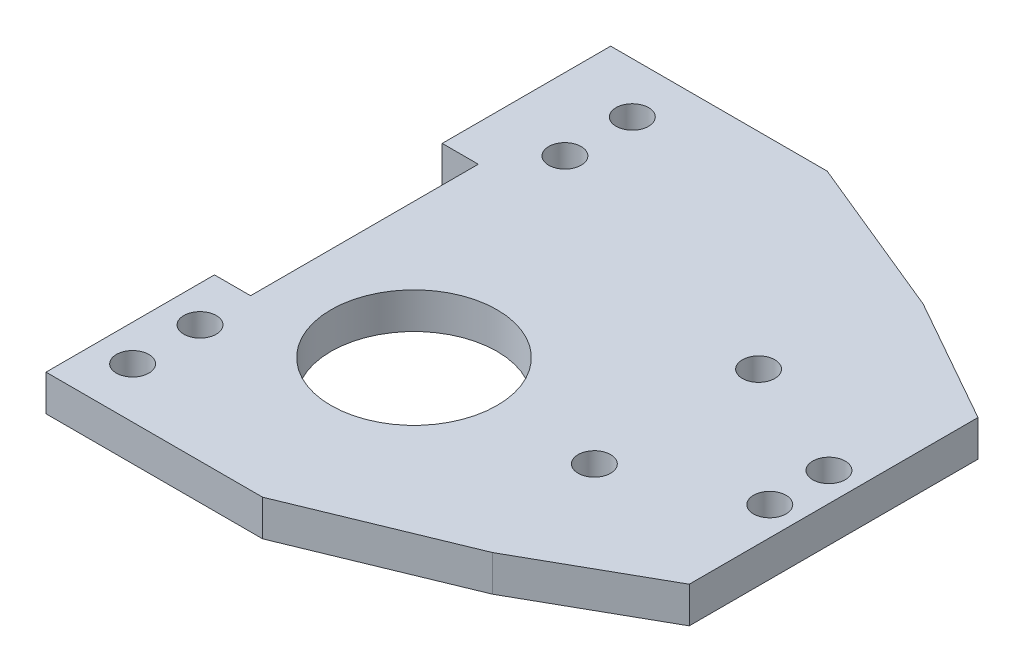
ISO-10303-21;
HEADER;
FILE_DESCRIPTION(('STEP AP214'),'2;1');
FILE_NAME('part.step','',(''),(''),'','','');
FILE_SCHEMA(('AUTOMOTIVE_DESIGN { 1 0 10303 214 1 1 1 1 }'));
ENDSEC;
DATA;
#1=APPLICATION_CONTEXT('core data for automotive mechanical design processes');
#2=APPLICATION_PROTOCOL_DEFINITION('international standard','automotive_design',2000,#1);
#3=PRODUCT_CONTEXT('',#1,'mechanical');
#4=PRODUCT('Part','Part','',(#3));
#5=PRODUCT_RELATED_PRODUCT_CATEGORY('part','',(#4));
#6=PRODUCT_DEFINITION_FORMATION('','',#4);
#7=PRODUCT_DEFINITION_CONTEXT('part definition',#1,'design');
#8=PRODUCT_DEFINITION('design','',#6,#7);
#9=PRODUCT_DEFINITION_SHAPE('','',#8);
#10=(LENGTH_UNIT() NAMED_UNIT(*) SI_UNIT(.MILLI.,.METRE.));
#11=(NAMED_UNIT(*) PLANE_ANGLE_UNIT() SI_UNIT($,.RADIAN.));
#12=(NAMED_UNIT(*) SI_UNIT($,.STERADIAN.) SOLID_ANGLE_UNIT());
#13=UNCERTAINTY_MEASURE_WITH_UNIT(LENGTH_MEASURE(1.E-05),#10,'distance_accuracy_value','');
#14=(GEOMETRIC_REPRESENTATION_CONTEXT(3) GLOBAL_UNCERTAINTY_ASSIGNED_CONTEXT((#13)) GLOBAL_UNIT_ASSIGNED_CONTEXT((#10,
#11,#12)) REPRESENTATION_CONTEXT('',''));
#15=CARTESIAN_POINT('',(0.,0.,0.));
#16=DIRECTION('',(0.,0.,1.));
#17=DIRECTION('',(1.,0.,0.));
#18=AXIS2_PLACEMENT_3D('',#15,#16,#17);
#19=CARTESIAN_POINT('',(-40.7506429404021,0.,15.7743934541941));
#20=DIRECTION('',(0.,0.,-1.));
#21=DIRECTION('',(-1.,0.,0.));
#22=AXIS2_PLACEMENT_3D('',#19,#20,#21);
#23=PLANE('',#22);
#24=DIRECTION('',(1.,0.,0.));
#25=VECTOR('',#24,1.);
#26=CARTESIAN_POINT('',(-40.7506429404021,-5.,15.7743934541941));
#27=LINE('',#26,#25);
#28=CARTESIAN_POINT('',(-40.7506429404021,-5.,15.7743934541941));
#29=VERTEX_POINT('',#28);
#30=CARTESIAN_POINT('',(-35.750642940402,-5.,15.7743934541941));
#31=VERTEX_POINT('',#30);
#32=EDGE_CURVE('E158',#29,#31,#27,.T.);
#33=ORIENTED_EDGE('',*,*,#32,.F.);
#34=DIRECTION('',(0.,-1.,0.));
#35=VECTOR('',#34,1.);
#36=CARTESIAN_POINT('',(-40.7506429404021,0.,15.7743934541941));
#37=LINE('',#36,#35);
#38=CARTESIAN_POINT('',(-40.7506429404021,0.,15.7743934541941));
#39=VERTEX_POINT('',#38);
#40=EDGE_CURVE('E11',#39,#29,#37,.T.);
#41=ORIENTED_EDGE('',*,*,#40,.F.);
#42=DIRECTION('',(1.,0.,0.));
#43=VECTOR('',#42,1.);
#44=CARTESIAN_POINT('',(-40.7506429404021,0.,15.7743934541941));
#45=LINE('',#44,#43);
#46=CARTESIAN_POINT('',(-35.750642940402,0.,15.7743934541941));
#47=VERTEX_POINT('',#46);
#48=EDGE_CURVE('E191',#39,#47,#45,.T.);
#49=ORIENTED_EDGE('',*,*,#48,.T.);
#50=DIRECTION('',(0.,-1.,0.));
#51=VECTOR('',#50,1.);
#52=CARTESIAN_POINT('',(-35.750642940402,0.,15.7743934541941));
#53=LINE('',#52,#51);
#54=EDGE_CURVE('E40',#47,#31,#53,.T.);
#55=ORIENTED_EDGE('',*,*,#54,.T.);
#56=EDGE_LOOP('',(#33,#41,#49,#55));
#57=FACE_BOUND('',#56,.T.);
#58=ADVANCED_FACE('F37',(#57),#23,.T.);
#59=CARTESIAN_POINT('',(-40.7506429404021,0.,39.1125659953177));
#60=DIRECTION('',(-1.,0.,0.));
#61=DIRECTION('',(0.,0.,1.));
#62=AXIS2_PLACEMENT_3D('',#59,#60,#61);
#63=PLANE('',#62);
#64=DIRECTION('',(0.,0.,-1.));
#65=VECTOR('',#64,1.);
#66=CARTESIAN_POINT('',(-40.7506429404021,-5.,39.1125659953177));
#67=LINE('',#66,#65);
#68=CARTESIAN_POINT('',(-40.7506429404021,-5.,39.1125659953177));
#69=VERTEX_POINT('',#68);
#70=EDGE_CURVE('E189',#69,#29,#67,.T.);
#71=ORIENTED_EDGE('',*,*,#70,.F.);
#72=DIRECTION('',(0.,-1.,0.));
#73=VECTOR('',#72,1.);
#74=CARTESIAN_POINT('',(-40.7506429404021,0.,39.1125659953177));
#75=LINE('',#74,#73);
#76=CARTESIAN_POINT('',(-40.7506429404021,0.,39.1125659953177));
#77=VERTEX_POINT('',#76);
#78=EDGE_CURVE('E46',#77,#69,#75,.T.);
#79=ORIENTED_EDGE('',*,*,#78,.F.);
#80=DIRECTION('',(0.,0.,-1.));
#81=VECTOR('',#80,1.);
#82=CARTESIAN_POINT('',(-40.7506429404021,0.,39.1125659953177));
#83=LINE('',#82,#81);
#84=EDGE_CURVE('E148',#77,#39,#83,.T.);
#85=ORIENTED_EDGE('',*,*,#84,.T.);
#86=ORIENTED_EDGE('',*,*,#40,.T.);
#87=EDGE_LOOP('',(#71,#79,#85,#86));
#88=FACE_BOUND('',#87,.T.);
#89=ADVANCED_FACE('F211',(#88),#63,.T.);
#90=CARTESIAN_POINT('',(-10.750642940402,0.,39.1125659953177));
#91=DIRECTION('',(0.,0.,1.));
#92=DIRECTION('',(1.,0.,0.));
#93=AXIS2_PLACEMENT_3D('',#90,#91,#92);
#94=PLANE('',#93);
#95=DIRECTION('',(-1.,0.,0.));
#96=VECTOR('',#95,1.);
#97=CARTESIAN_POINT('',(-10.750642940402,-5.,39.1125659953177));
#98=LINE('',#97,#96);
#99=CARTESIAN_POINT('',(-10.750642940402,-5.,39.1125659953177));
#100=VERTEX_POINT('',#99);
#101=EDGE_CURVE('E135',#100,#69,#98,.T.);
#102=ORIENTED_EDGE('',*,*,#101,.F.);
#103=DIRECTION('',(0.,-1.,0.));
#104=VECTOR('',#103,1.);
#105=CARTESIAN_POINT('',(-10.750642940402,0.,39.1125659953177));
#106=LINE('',#105,#104);
#107=CARTESIAN_POINT('',(-10.750642940402,0.,39.1125659953177));
#108=VERTEX_POINT('',#107);
#109=EDGE_CURVE('E130',#108,#100,#106,.T.);
#110=ORIENTED_EDGE('',*,*,#109,.F.);
#111=DIRECTION('',(-1.,0.,0.));
#112=VECTOR('',#111,1.);
#113=CARTESIAN_POINT('',(-10.750642940402,0.,39.1125659953177));
#114=LINE('',#113,#112);
#115=EDGE_CURVE('E133',#108,#77,#114,.T.);
#116=ORIENTED_EDGE('',*,*,#115,.T.);
#117=ORIENTED_EDGE('',*,*,#78,.T.);
#118=EDGE_LOOP('',(#102,#110,#116,#117));
#119=FACE_BOUND('',#118,.T.);
#120=ADVANCED_FACE('F132',(#119),#94,.T.);
#121=CARTESIAN_POINT('',(11.8281740085253,0.,29.8235625462976));
#122=DIRECTION('',(0.380464141149531,0.,0.924795673270236));
#123=DIRECTION('',(0.924795673270236,0.,-0.380464141149531));
#124=AXIS2_PLACEMENT_3D('',#121,#122,#123);
#125=PLANE('',#124);
#126=DIRECTION('',(-0.924795673270236,0.,0.380464141149531));
#127=VECTOR('',#126,1.);
#128=CARTESIAN_POINT('',(11.8281740085253,-5.,29.8235625462976));
#129=LINE('',#128,#127);
#130=CARTESIAN_POINT('',(11.8281740085253,-5.,29.8235625462976));
#131=VERTEX_POINT('',#130);
#132=EDGE_CURVE('E186',#131,#100,#129,.T.);
#133=ORIENTED_EDGE('',*,*,#132,.F.);
#134=DIRECTION('',(0.,-1.,0.));
#135=VECTOR('',#134,1.);
#136=CARTESIAN_POINT('',(11.8281740085253,0.,29.8235625462976));
#137=LINE('',#136,#135);
#138=CARTESIAN_POINT('',(11.8281740085253,0.,29.8235625462976));
#139=VERTEX_POINT('',#138);
#140=EDGE_CURVE('E140',#139,#131,#137,.T.);
#141=ORIENTED_EDGE('',*,*,#140,.F.);
#142=DIRECTION('',(-0.924795673270236,0.,0.380464141149531));
#143=VECTOR('',#142,1.);
#144=CARTESIAN_POINT('',(11.8281740085253,0.,29.8235625462976));
#145=LINE('',#144,#143);
#146=EDGE_CURVE('E146',#139,#108,#145,.T.);
#147=ORIENTED_EDGE('',*,*,#146,.T.);
#148=ORIENTED_EDGE('',*,*,#109,.T.);
#149=EDGE_LOOP('',(#133,#141,#147,#148));
#150=FACE_BOUND('',#149,.T.);
#151=ADVANCED_FACE('F150',(#150),#125,.T.);
#152=CARTESIAN_POINT('',(29.249357059598,0.,20.));
#153=DIRECTION('',(0.491178127314878,0.,0.871059152553631));
#154=DIRECTION('',(0.871059152553631,0.,-0.491178127314878));
#155=AXIS2_PLACEMENT_3D('',#152,#153,#154);
#156=PLANE('',#155);
#157=DIRECTION('',(-0.871059152553631,0.,0.491178127314878));
#158=VECTOR('',#157,1.);
#159=CARTESIAN_POINT('',(29.249357059598,-5.,20.));
#160=LINE('',#159,#158);
#161=CARTESIAN_POINT('',(29.249357059598,-5.,20.));
#162=VERTEX_POINT('',#161);
#163=EDGE_CURVE('E183',#162,#131,#160,.T.);
#164=ORIENTED_EDGE('',*,*,#163,.F.);
#165=DIRECTION('',(0.,-1.,0.));
#166=VECTOR('',#165,1.);
#167=CARTESIAN_POINT('',(29.249357059598,0.,20.));
#168=LINE('',#167,#166);
#169=CARTESIAN_POINT('',(29.249357059598,0.,20.));
#170=VERTEX_POINT('',#169);
#171=EDGE_CURVE('E195',#170,#162,#168,.T.);
#172=ORIENTED_EDGE('',*,*,#171,.F.);
#173=DIRECTION('',(-0.871059152553631,0.,0.491178127314878));
#174=VECTOR('',#173,1.);
#175=CARTESIAN_POINT('',(29.249357059598,0.,20.));
#176=LINE('',#175,#174);
#177=EDGE_CURVE('E151',#170,#139,#176,.T.);
#178=ORIENTED_EDGE('',*,*,#177,.T.);
#179=ORIENTED_EDGE('',*,*,#140,.T.);
#180=EDGE_LOOP('',(#164,#172,#178,#179));
#181=FACE_BOUND('',#180,.T.);
#182=ADVANCED_FACE('F224',(#181),#156,.T.);
#183=CARTESIAN_POINT('',(29.249357059598,0.,-20.));
#184=DIRECTION('',(1.,0.,0.));
#185=DIRECTION('',(0.,0.,-1.));
#186=AXIS2_PLACEMENT_3D('',#183,#184,#185);
#187=PLANE('',#186);
#188=DIRECTION('',(0.,0.,1.));
#189=VECTOR('',#188,1.);
#190=CARTESIAN_POINT('',(29.249357059598,-5.,-20.));
#191=LINE('',#190,#189);
#192=CARTESIAN_POINT('',(29.249357059598,-5.,-20.));
#193=VERTEX_POINT('',#192);
#194=EDGE_CURVE('E180',#193,#162,#191,.T.);
#195=ORIENTED_EDGE('',*,*,#194,.F.);
#196=DIRECTION('',(0.,-1.,0.));
#197=VECTOR('',#196,1.);
#198=CARTESIAN_POINT('',(29.249357059598,0.,-20.));
#199=LINE('',#198,#197);
#200=CARTESIAN_POINT('',(29.249357059598,0.,-20.));
#201=VERTEX_POINT('',#200);
#202=EDGE_CURVE('E197',#201,#193,#199,.T.);
#203=ORIENTED_EDGE('',*,*,#202,.F.);
#204=DIRECTION('',(0.,0.,1.));
#205=VECTOR('',#204,1.);
#206=CARTESIAN_POINT('',(29.249357059598,0.,-20.));
#207=LINE('',#206,#205);
#208=EDGE_CURVE('E153',#201,#170,#207,.T.);
#209=ORIENTED_EDGE('',*,*,#208,.T.);
#210=ORIENTED_EDGE('',*,*,#171,.T.);
#211=EDGE_LOOP('',(#195,#203,#209,#210));
#212=FACE_BOUND('',#211,.T.);
#213=ADVANCED_FACE('F227',(#212),#187,.T.);
#214=CARTESIAN_POINT('',(11.8281740085253,0.,-29.8235625462976));
#215=DIRECTION('',(0.491178127314878,0.,-0.871059152553631));
#216=DIRECTION('',(-0.871059152553631,0.,-0.491178127314878));
#217=AXIS2_PLACEMENT_3D('',#214,#215,#216);
#218=PLANE('',#217);
#219=DIRECTION('',(0.871059152553631,0.,0.491178127314878));
#220=VECTOR('',#219,1.);
#221=CARTESIAN_POINT('',(11.8281740085253,-5.,-29.8235625462976));
#222=LINE('',#221,#220);
#223=CARTESIAN_POINT('',(11.8281740085253,-5.,-29.8235625462976));
#224=VERTEX_POINT('',#223);
#225=EDGE_CURVE('E177',#224,#193,#222,.T.);
#226=ORIENTED_EDGE('',*,*,#225,.F.);
#227=DIRECTION('',(0.,-1.,0.));
#228=VECTOR('',#227,1.);
#229=CARTESIAN_POINT('',(11.8281740085253,0.,-29.8235625462976));
#230=LINE('',#229,#228);
#231=CARTESIAN_POINT('',(11.8281740085253,0.,-29.8235625462976));
#232=VERTEX_POINT('',#231);
#233=EDGE_CURVE('E199',#232,#224,#230,.T.);
#234=ORIENTED_EDGE('',*,*,#233,.F.);
#235=DIRECTION('',(0.871059152553631,0.,0.491178127314878));
#236=VECTOR('',#235,1.);
#237=CARTESIAN_POINT('',(11.8281740085253,0.,-29.8235625462976));
#238=LINE('',#237,#236);
#239=EDGE_CURVE('E371',#232,#201,#238,.T.);
#240=ORIENTED_EDGE('',*,*,#239,.T.);
#241=ORIENTED_EDGE('',*,*,#202,.T.);
#242=EDGE_LOOP('',(#226,#234,#240,#241));
#243=FACE_BOUND('',#242,.T.);
#244=ADVANCED_FACE('F231',(#243),#218,.T.);
#245=CARTESIAN_POINT('',(-10.750642940402,0.,-39.1125659953177));
#246=DIRECTION('',(0.380464141149529,0.,-0.924795673270237));
#247=DIRECTION('',(-0.924795673270237,0.,-0.380464141149529));
#248=AXIS2_PLACEMENT_3D('',#245,#246,#247);
#249=PLANE('',#248);
#250=DIRECTION('',(0.924795673270237,0.,0.380464141149529));
#251=VECTOR('',#250,1.);
#252=CARTESIAN_POINT('',(-10.750642940402,-5.,-39.1125659953177));
#253=LINE('',#252,#251);
#254=CARTESIAN_POINT('',(-10.750642940402,-5.,-39.1125659953177));
#255=VERTEX_POINT('',#254);
#256=EDGE_CURVE('E174',#255,#224,#253,.T.);
#257=ORIENTED_EDGE('',*,*,#256,.F.);
#258=DIRECTION('',(0.,-1.,0.));
#259=VECTOR('',#258,1.);
#260=CARTESIAN_POINT('',(-10.750642940402,0.,-39.1125659953177));
#261=LINE('',#260,#259);
#262=CARTESIAN_POINT('',(-10.750642940402,0.,-39.1125659953177));
#263=VERTEX_POINT('',#262);
#264=EDGE_CURVE('E201',#263,#255,#261,.T.);
#265=ORIENTED_EDGE('',*,*,#264,.F.);
#266=DIRECTION('',(0.924795673270237,0.,0.380464141149529));
#267=VECTOR('',#266,1.);
#268=CARTESIAN_POINT('',(-10.750642940402,0.,-39.1125659953177));
#269=LINE('',#268,#267);
#270=EDGE_CURVE('E368',#263,#232,#269,.T.);
#271=ORIENTED_EDGE('',*,*,#270,.T.);
#272=ORIENTED_EDGE('',*,*,#233,.T.);
#273=EDGE_LOOP('',(#257,#265,#271,#272));
#274=FACE_BOUND('',#273,.T.);
#275=ADVANCED_FACE('F235',(#274),#249,.T.);
#276=CARTESIAN_POINT('',(-40.7506429404021,0.,-39.1125659953177));
#277=DIRECTION('',(0.,0.,-1.));
#278=DIRECTION('',(-1.,0.,0.));
#279=AXIS2_PLACEMENT_3D('',#276,#277,#278);
#280=PLANE('',#279);
#281=DIRECTION('',(1.,0.,0.));
#282=VECTOR('',#281,1.);
#283=CARTESIAN_POINT('',(-40.7506429404021,-5.,-39.1125659953177));
#284=LINE('',#283,#282);
#285=CARTESIAN_POINT('',(-40.7506429404021,-5.,-39.1125659953177));
#286=VERTEX_POINT('',#285);
#287=EDGE_CURVE('E171',#286,#255,#284,.T.);
#288=ORIENTED_EDGE('',*,*,#287,.F.);
#289=DIRECTION('',(0.,-1.,0.));
#290=VECTOR('',#289,1.);
#291=CARTESIAN_POINT('',(-40.7506429404021,0.,-39.1125659953177));
#292=LINE('',#291,#290);
#293=CARTESIAN_POINT('',(-40.7506429404021,0.,-39.1125659953177));
#294=VERTEX_POINT('',#293);
#295=EDGE_CURVE('E203',#294,#286,#292,.T.);
#296=ORIENTED_EDGE('',*,*,#295,.F.);
#297=DIRECTION('',(1.,0.,0.));
#298=VECTOR('',#297,1.);
#299=CARTESIAN_POINT('',(-40.7506429404021,0.,-39.1125659953177));
#300=LINE('',#299,#298);
#301=EDGE_CURVE('E365',#294,#263,#300,.T.);
#302=ORIENTED_EDGE('',*,*,#301,.T.);
#303=ORIENTED_EDGE('',*,*,#264,.T.);
#304=EDGE_LOOP('',(#288,#296,#302,#303));
#305=FACE_BOUND('',#304,.T.);
#306=ADVANCED_FACE('F239',(#305),#280,.T.);
#307=CARTESIAN_POINT('',(-40.7506429404021,0.,-15.7743934541941));
#308=DIRECTION('',(-1.,0.,0.));
#309=DIRECTION('',(0.,0.,1.));
#310=AXIS2_PLACEMENT_3D('',#307,#308,#309);
#311=PLANE('',#310);
#312=DIRECTION('',(0.,0.,-1.));
#313=VECTOR('',#312,1.);
#314=CARTESIAN_POINT('',(-40.7506429404021,-5.,-15.7743934541941));
#315=LINE('',#314,#313);
#316=CARTESIAN_POINT('',(-40.7506429404021,-5.,-15.7743934541941));
#317=VERTEX_POINT('',#316);
#318=EDGE_CURVE('E168',#317,#286,#315,.T.);
#319=ORIENTED_EDGE('',*,*,#318,.F.);
#320=DIRECTION('',(0.,-1.,0.));
#321=VECTOR('',#320,1.);
#322=CARTESIAN_POINT('',(-40.7506429404021,0.,-15.7743934541941));
#323=LINE('',#322,#321);
#324=CARTESIAN_POINT('',(-40.7506429404021,0.,-15.7743934541941));
#325=VERTEX_POINT('',#324);
#326=EDGE_CURVE('E205',#325,#317,#323,.T.);
#327=ORIENTED_EDGE('',*,*,#326,.F.);
#328=DIRECTION('',(0.,0.,-1.));
#329=VECTOR('',#328,1.);
#330=CARTESIAN_POINT('',(-40.7506429404021,0.,-15.7743934541941));
#331=LINE('',#330,#329);
#332=EDGE_CURVE('E362',#325,#294,#331,.T.);
#333=ORIENTED_EDGE('',*,*,#332,.T.);
#334=ORIENTED_EDGE('',*,*,#295,.T.);
#335=EDGE_LOOP('',(#319,#327,#333,#334));
#336=FACE_BOUND('',#335,.T.);
#337=ADVANCED_FACE('F243',(#336),#311,.T.);
#338=CARTESIAN_POINT('',(-35.750642940402,0.,-15.7743934541941));
#339=DIRECTION('',(0.,0.,1.));
#340=DIRECTION('',(1.,0.,0.));
#341=AXIS2_PLACEMENT_3D('',#338,#339,#340);
#342=PLANE('',#341);
#343=DIRECTION('',(-1.,0.,0.));
#344=VECTOR('',#343,1.);
#345=CARTESIAN_POINT('',(-35.750642940402,-5.,-15.7743934541941));
#346=LINE('',#345,#344);
#347=CARTESIAN_POINT('',(-35.750642940402,-5.,-15.7743934541941));
#348=VERTEX_POINT('',#347);
#349=EDGE_CURVE('E165',#348,#317,#346,.T.);
#350=ORIENTED_EDGE('',*,*,#349,.F.);
#351=DIRECTION('',(0.,-1.,0.));
#352=VECTOR('',#351,1.);
#353=CARTESIAN_POINT('',(-35.750642940402,0.,-15.7743934541941));
#354=LINE('',#353,#352);
#355=CARTESIAN_POINT('',(-35.750642940402,0.,-15.7743934541941));
#356=VERTEX_POINT('',#355);
#357=EDGE_CURVE('E206',#356,#348,#354,.T.);
#358=ORIENTED_EDGE('',*,*,#357,.F.);
#359=DIRECTION('',(-1.,0.,0.));
#360=VECTOR('',#359,1.);
#361=CARTESIAN_POINT('',(-35.750642940402,0.,-15.7743934541941));
#362=LINE('',#361,#360);
#363=EDGE_CURVE('E359',#356,#325,#362,.T.);
#364=ORIENTED_EDGE('',*,*,#363,.T.);
#365=ORIENTED_EDGE('',*,*,#326,.T.);
#366=EDGE_LOOP('',(#350,#358,#364,#365));
#367=FACE_BOUND('',#366,.T.);
#368=ADVANCED_FACE('F247',(#367),#342,.T.);
#369=CARTESIAN_POINT('',(-35.750642940402,0.,15.7743934541941));
#370=DIRECTION('',(-1.,0.,0.));
#371=DIRECTION('',(0.,0.,1.));
#372=AXIS2_PLACEMENT_3D('',#369,#370,#371);
#373=PLANE('',#372);
#374=DIRECTION('',(0.,0.,-1.));
#375=VECTOR('',#374,1.);
#376=CARTESIAN_POINT('',(-35.750642940402,-5.,15.7743934541941));
#377=LINE('',#376,#375);
#378=EDGE_CURVE('E161',#31,#348,#377,.T.);
#379=ORIENTED_EDGE('',*,*,#378,.F.);
#380=ORIENTED_EDGE('',*,*,#54,.F.);
#381=DIRECTION('',(0.,0.,-1.));
#382=VECTOR('',#381,1.);
#383=CARTESIAN_POINT('',(-35.750642940402,0.,15.7743934541941));
#384=LINE('',#383,#382);
#385=EDGE_CURVE('E357',#47,#356,#384,.T.);
#386=ORIENTED_EDGE('',*,*,#385,.T.);
#387=ORIENTED_EDGE('',*,*,#357,.T.);
#388=EDGE_LOOP('',(#379,#380,#386,#387));
#389=FACE_BOUND('',#388,.T.);
#390=ADVANCED_FACE('F208',(#389),#373,.T.);
#391=CARTESIAN_POINT('',(0.,0.,0.));
#392=DIRECTION('',(0.,1.,0.));
#393=DIRECTION('',(0.,0.,1.));
#394=AXIS2_PLACEMENT_3D('',#391,#392,#393);
#395=PLANE('',#394);
#396=CARTESIAN_POINT('',(-35.750642940402,0.,32.1125659953177));
#397=DIRECTION('',(0.,-1.,0.));
#398=DIRECTION('',(0.,0.,-1.));
#399=AXIS2_PLACEMENT_3D('',#396,#397,#398);
#400=CIRCLE('',#399,2.25);
#401=CARTESIAN_POINT('',(-35.750642940402,0.,29.8625659953177));
#402=VERTEX_POINT('',#401);
#403=EDGE_CURVE('E302',#402,#402,#400,.T.);
#404=ORIENTED_EDGE('',*,*,#403,.T.);
#405=EDGE_LOOP('',(#404));
#406=FACE_BOUND('',#405,.T.);
#407=CARTESIAN_POINT('',(-35.750642940402,0.,22.7743934541941));
#408=DIRECTION('',(0.,-1.,0.));
#409=DIRECTION('',(0.,0.,-1.));
#410=AXIS2_PLACEMENT_3D('',#407,#408,#409);
#411=CIRCLE('',#410,2.25);
#412=CARTESIAN_POINT('',(-35.750642940402,0.,20.524393454194));
#413=VERTEX_POINT('',#412);
#414=EDGE_CURVE('E310',#413,#413,#411,.T.);
#415=ORIENTED_EDGE('',*,*,#414,.T.);
#416=EDGE_LOOP('',(#415));
#417=FACE_BOUND('',#416,.T.);
#418=CARTESIAN_POINT('',(8.24660230807,0.,12.1439333667532));
#419=DIRECTION('',(0.,-1.,0.));
#420=DIRECTION('',(0.,0.,1.));
#421=AXIS2_PLACEMENT_3D('',#418,#419,#420);
#422=CIRCLE('',#421,2.25);
#423=CARTESIAN_POINT('',(8.24660230807,0.,14.3939333667532));
#424=VERTEX_POINT('',#423);
#425=EDGE_CURVE('E316',#424,#424,#422,.T.);
#426=ORIENTED_EDGE('',*,*,#425,.T.);
#427=EDGE_LOOP('',(#426));
#428=FACE_BOUND('',#427,.T.);
#429=CARTESIAN_POINT('',(-17.00339769193,0.,11.8786432611245));
#430=DIRECTION('',(0.,-1.,0.));
#431=DIRECTION('',(0.,0.,-1.));
#432=AXIS2_PLACEMENT_3D('',#429,#430,#431);
#433=CIRCLE('',#432,11.5);
#434=CARTESIAN_POINT('',(-17.00339769193,0.,0.37864326112449));
#435=VERTEX_POINT('',#434);
#436=EDGE_CURVE('E322',#435,#435,#433,.T.);
#437=ORIENTED_EDGE('',*,*,#436,.T.);
#438=EDGE_LOOP('',(#437));
#439=FACE_BOUND('',#438,.T.);
#440=CARTESIAN_POINT('',(-30.750642940402,0.,-32.1125659953177));
#441=DIRECTION('',(0.,-1.,0.));
#442=DIRECTION('',(0.,0.,1.));
#443=AXIS2_PLACEMENT_3D('',#440,#441,#442);
#444=CIRCLE('',#443,2.25);
#445=CARTESIAN_POINT('',(-30.750642940402,0.,-29.8625659953177));
#446=VERTEX_POINT('',#445);
#447=EDGE_CURVE('E328',#446,#446,#444,.T.);
#448=ORIENTED_EDGE('',*,*,#447,.T.);
#449=EDGE_LOOP('',(#448));
#450=FACE_BOUND('',#449,.T.);
#451=CARTESIAN_POINT('',(25.2728329853276,0.,4.86755246470138));
#452=DIRECTION('',(0.,-1.,0.));
#453=DIRECTION('',(0.,0.,1.));
#454=AXIS2_PLACEMENT_3D('',#451,#452,#453);
#455=CIRCLE('',#454,2.25);
#456=CARTESIAN_POINT('',(25.2728329853276,0.,7.11755246470138));
#457=VERTEX_POINT('',#456);
#458=EDGE_CURVE('E334',#457,#457,#455,.T.);
#459=ORIENTED_EDGE('',*,*,#458,.T.);
#460=EDGE_LOOP('',(#459));
#461=FACE_BOUND('',#460,.T.);
#462=CARTESIAN_POINT('',(8.24660230807,0.,-10.6060666332468));
#463=DIRECTION('',(0.,-1.,0.));
#464=DIRECTION('',(0.,0.,1.));
#465=AXIS2_PLACEMENT_3D('',#462,#463,#464);
#466=CIRCLE('',#465,2.25);
#467=CARTESIAN_POINT('',(8.24660230807,0.,-8.3560666332468));
#468=VERTEX_POINT('',#467);
#469=EDGE_CURVE('E340',#468,#468,#466,.T.);
#470=ORIENTED_EDGE('',*,*,#469,.T.);
#471=EDGE_LOOP('',(#470));
#472=FACE_BOUND('',#471,.T.);
#473=CARTESIAN_POINT('',(25.2728329853278,0.,-3.32968573119602));
#474=DIRECTION('',(0.,-1.,0.));
#475=DIRECTION('',(0.,0.,1.));
#476=AXIS2_PLACEMENT_3D('',#473,#474,#475);
#477=CIRCLE('',#476,2.25);
#478=CARTESIAN_POINT('',(25.2728329853278,0.,-1.07968573119602));
#479=VERTEX_POINT('',#478);
#480=EDGE_CURVE('E346',#479,#479,#477,.T.);
#481=ORIENTED_EDGE('',*,*,#480,.T.);
#482=EDGE_LOOP('',(#481));
#483=FACE_BOUND('',#482,.T.);
#484=CARTESIAN_POINT('',(-30.750642940402,0.,-22.7743934541941));
#485=DIRECTION('',(0.,-1.,0.));
#486=DIRECTION('',(0.,0.,1.));
#487=AXIS2_PLACEMENT_3D('',#484,#485,#486);
#488=CIRCLE('',#487,2.25);
#489=CARTESIAN_POINT('',(-30.750642940402,0.,-20.5243934541941));
#490=VERTEX_POINT('',#489);
#491=EDGE_CURVE('E162',#490,#490,#488,.T.);
#492=ORIENTED_EDGE('',*,*,#491,.T.);
#493=EDGE_LOOP('',(#492));
#494=FACE_BOUND('',#493,.T.);
#495=ORIENTED_EDGE('',*,*,#48,.F.);
#496=ORIENTED_EDGE('',*,*,#84,.F.);
#497=ORIENTED_EDGE('',*,*,#115,.F.);
#498=ORIENTED_EDGE('',*,*,#146,.F.);
#499=ORIENTED_EDGE('',*,*,#177,.F.);
#500=ORIENTED_EDGE('',*,*,#208,.F.);
#501=ORIENTED_EDGE('',*,*,#239,.F.);
#502=ORIENTED_EDGE('',*,*,#270,.F.);
#503=ORIENTED_EDGE('',*,*,#301,.F.);
#504=ORIENTED_EDGE('',*,*,#332,.F.);
#505=ORIENTED_EDGE('',*,*,#363,.F.);
#506=ORIENTED_EDGE('',*,*,#385,.F.);
#507=EDGE_LOOP('',(#495,#496,#497,#498,#499,#500,#501,#502,#503,#504,#505,#506));
#508=FACE_BOUND('',#507,.T.);
#509=ADVANCED_FACE('F144',(#406,#417,#428,#439,#450,#461,#472,#483,#494,#508),#395,.T.);
#510=CARTESIAN_POINT('',(0.,-5.,0.));
#511=DIRECTION('',(0.,1.,0.));
#512=DIRECTION('',(0.,0.,1.));
#513=AXIS2_PLACEMENT_3D('',#510,#511,#512);
#514=PLANE('',#513);
#515=CARTESIAN_POINT('',(-35.750642940402,-5.,32.1125659953177));
#516=DIRECTION('',(0.,-1.,0.));
#517=DIRECTION('',(0.,0.,-1.));
#518=AXIS2_PLACEMENT_3D('',#515,#516,#517);
#519=CIRCLE('',#518,2.25);
#520=CARTESIAN_POINT('',(-35.750642940402,-5.,29.8625659953177));
#521=VERTEX_POINT('',#520);
#522=EDGE_CURVE('E305',#521,#521,#519,.T.);
#523=ORIENTED_EDGE('',*,*,#522,.F.);
#524=EDGE_LOOP('',(#523));
#525=FACE_BOUND('',#524,.T.);
#526=CARTESIAN_POINT('',(-35.750642940402,-5.,22.7743934541941));
#527=DIRECTION('',(0.,-1.,0.));
#528=DIRECTION('',(0.,0.,-1.));
#529=AXIS2_PLACEMENT_3D('',#526,#527,#528);
#530=CIRCLE('',#529,2.25);
#531=CARTESIAN_POINT('',(-35.750642940402,-5.,20.524393454194));
#532=VERTEX_POINT('',#531);
#533=EDGE_CURVE('E307',#532,#532,#530,.T.);
#534=ORIENTED_EDGE('',*,*,#533,.F.);
#535=EDGE_LOOP('',(#534));
#536=FACE_BOUND('',#535,.T.);
#537=CARTESIAN_POINT('',(8.24660230807,-5.,12.1439333667532));
#538=DIRECTION('',(0.,-1.,0.));
#539=DIRECTION('',(0.,0.,1.));
#540=AXIS2_PLACEMENT_3D('',#537,#538,#539);
#541=CIRCLE('',#540,2.25);
#542=CARTESIAN_POINT('',(8.24660230807,-5.,14.3939333667532));
#543=VERTEX_POINT('',#542);
#544=EDGE_CURVE('E313',#543,#543,#541,.T.);
#545=ORIENTED_EDGE('',*,*,#544,.F.);
#546=EDGE_LOOP('',(#545));
#547=FACE_BOUND('',#546,.T.);
#548=CARTESIAN_POINT('',(-17.00339769193,-5.,11.8786432611245));
#549=DIRECTION('',(0.,-1.,0.));
#550=DIRECTION('',(0.,0.,-1.));
#551=AXIS2_PLACEMENT_3D('',#548,#549,#550);
#552=CIRCLE('',#551,11.5);
#553=CARTESIAN_POINT('',(-17.00339769193,-5.,0.37864326112449));
#554=VERTEX_POINT('',#553);
#555=EDGE_CURVE('E319',#554,#554,#552,.T.);
#556=ORIENTED_EDGE('',*,*,#555,.F.);
#557=EDGE_LOOP('',(#556));
#558=FACE_BOUND('',#557,.T.);
#559=CARTESIAN_POINT('',(-30.750642940402,-5.,-32.1125659953177));
#560=DIRECTION('',(0.,-1.,0.));
#561=DIRECTION('',(0.,0.,1.));
#562=AXIS2_PLACEMENT_3D('',#559,#560,#561);
#563=CIRCLE('',#562,2.25);
#564=CARTESIAN_POINT('',(-30.750642940402,-5.,-29.8625659953177));
#565=VERTEX_POINT('',#564);
#566=EDGE_CURVE('E325',#565,#565,#563,.T.);
#567=ORIENTED_EDGE('',*,*,#566,.F.);
#568=EDGE_LOOP('',(#567));
#569=FACE_BOUND('',#568,.T.);
#570=CARTESIAN_POINT('',(25.2728329853276,-5.,4.86755246470138));
#571=DIRECTION('',(0.,-1.,0.));
#572=DIRECTION('',(0.,0.,1.));
#573=AXIS2_PLACEMENT_3D('',#570,#571,#572);
#574=CIRCLE('',#573,2.25);
#575=CARTESIAN_POINT('',(25.2728329853276,-5.,7.11755246470138));
#576=VERTEX_POINT('',#575);
#577=EDGE_CURVE('E331',#576,#576,#574,.T.);
#578=ORIENTED_EDGE('',*,*,#577,.F.);
#579=EDGE_LOOP('',(#578));
#580=FACE_BOUND('',#579,.T.);
#581=CARTESIAN_POINT('',(8.24660230807,-5.,-10.6060666332468));
#582=DIRECTION('',(0.,-1.,0.));
#583=DIRECTION('',(0.,0.,1.));
#584=AXIS2_PLACEMENT_3D('',#581,#582,#583);
#585=CIRCLE('',#584,2.25);
#586=CARTESIAN_POINT('',(8.24660230807,-5.,-8.3560666332468));
#587=VERTEX_POINT('',#586);
#588=EDGE_CURVE('E337',#587,#587,#585,.T.);
#589=ORIENTED_EDGE('',*,*,#588,.F.);
#590=EDGE_LOOP('',(#589));
#591=FACE_BOUND('',#590,.T.);
#592=CARTESIAN_POINT('',(25.2728329853278,-5.,-3.32968573119602));
#593=DIRECTION('',(0.,-1.,0.));
#594=DIRECTION('',(0.,0.,1.));
#595=AXIS2_PLACEMENT_3D('',#592,#593,#594);
#596=CIRCLE('',#595,2.25);
#597=CARTESIAN_POINT('',(25.2728329853278,-5.,-1.07968573119602));
#598=VERTEX_POINT('',#597);
#599=EDGE_CURVE('E343',#598,#598,#596,.T.);
#600=ORIENTED_EDGE('',*,*,#599,.F.);
#601=EDGE_LOOP('',(#600));
#602=FACE_BOUND('',#601,.T.);
#603=CARTESIAN_POINT('',(-30.750642940402,-5.,-22.7743934541941));
#604=DIRECTION('',(0.,-1.,0.));
#605=DIRECTION('',(0.,0.,1.));
#606=AXIS2_PLACEMENT_3D('',#603,#604,#605);
#607=CIRCLE('',#606,2.25);
#608=CARTESIAN_POINT('',(-30.750642940402,-5.,-20.5243934541941));
#609=VERTEX_POINT('',#608);
#610=EDGE_CURVE('E349',#609,#609,#607,.T.);
#611=ORIENTED_EDGE('',*,*,#610,.F.);
#612=EDGE_LOOP('',(#611));
#613=FACE_BOUND('',#612,.T.);
#614=ORIENTED_EDGE('',*,*,#32,.T.);
#615=ORIENTED_EDGE('',*,*,#378,.T.);
#616=ORIENTED_EDGE('',*,*,#349,.T.);
#617=ORIENTED_EDGE('',*,*,#318,.T.);
#618=ORIENTED_EDGE('',*,*,#287,.T.);
#619=ORIENTED_EDGE('',*,*,#256,.T.);
#620=ORIENTED_EDGE('',*,*,#225,.T.);
#621=ORIENTED_EDGE('',*,*,#194,.T.);
#622=ORIENTED_EDGE('',*,*,#163,.T.);
#623=ORIENTED_EDGE('',*,*,#132,.T.);
#624=ORIENTED_EDGE('',*,*,#101,.T.);
#625=ORIENTED_EDGE('',*,*,#70,.T.);
#626=EDGE_LOOP('',(#614,#615,#616,#617,#618,#619,#620,#621,#622,#623,#624,#625));
#627=FACE_BOUND('',#626,.T.);
#628=ADVANCED_FACE('F210',(#525,#536,#547,#558,#569,#580,#591,#602,#613,#627),#514,.F.);
#629=CARTESIAN_POINT('',(-30.750642940402,0.,-22.7743934541941));
#630=DIRECTION('',(0.,-1.,0.));
#631=DIRECTION('',(0.,0.,-1.));
#632=AXIS2_PLACEMENT_3D('',#629,#630,#631);
#633=CYLINDRICAL_SURFACE('',#632,2.25);
#634=ORIENTED_EDGE('',*,*,#491,.F.);
#635=EDGE_LOOP('',(#634));
#636=FACE_BOUND('',#635,.T.);
#637=ORIENTED_EDGE('',*,*,#610,.T.);
#638=EDGE_LOOP('',(#637));
#639=FACE_BOUND('',#638,.T.);
#640=ADVANCED_FACE('F259',(#636,#639),#633,.F.);
#641=CARTESIAN_POINT('',(25.2728329853278,0.,-3.32968573119602));
#642=DIRECTION('',(0.,-1.,0.));
#643=DIRECTION('',(0.,0.,-1.));
#644=AXIS2_PLACEMENT_3D('',#641,#642,#643);
#645=CYLINDRICAL_SURFACE('',#644,2.25);
#646=ORIENTED_EDGE('',*,*,#480,.F.);
#647=EDGE_LOOP('',(#646));
#648=FACE_BOUND('',#647,.T.);
#649=ORIENTED_EDGE('',*,*,#599,.T.);
#650=EDGE_LOOP('',(#649));
#651=FACE_BOUND('',#650,.T.);
#652=ADVANCED_FACE('F266',(#648,#651),#645,.F.);
#653=CARTESIAN_POINT('',(8.24660230807,0.,-10.6060666332468));
#654=DIRECTION('',(0.,-1.,0.));
#655=DIRECTION('',(0.,0.,-1.));
#656=AXIS2_PLACEMENT_3D('',#653,#654,#655);
#657=CYLINDRICAL_SURFACE('',#656,2.25);
#658=ORIENTED_EDGE('',*,*,#469,.F.);
#659=EDGE_LOOP('',(#658));
#660=FACE_BOUND('',#659,.T.);
#661=ORIENTED_EDGE('',*,*,#588,.T.);
#662=EDGE_LOOP('',(#661));
#663=FACE_BOUND('',#662,.T.);
#664=ADVANCED_FACE('F270',(#660,#663),#657,.F.);
#665=CARTESIAN_POINT('',(25.2728329853276,0.,4.86755246470138));
#666=DIRECTION('',(0.,-1.,0.));
#667=DIRECTION('',(0.,0.,-1.));
#668=AXIS2_PLACEMENT_3D('',#665,#666,#667);
#669=CYLINDRICAL_SURFACE('',#668,2.25);
#670=ORIENTED_EDGE('',*,*,#458,.F.);
#671=EDGE_LOOP('',(#670));
#672=FACE_BOUND('',#671,.T.);
#673=ORIENTED_EDGE('',*,*,#577,.T.);
#674=EDGE_LOOP('',(#673));
#675=FACE_BOUND('',#674,.T.);
#676=ADVANCED_FACE('F274',(#672,#675),#669,.F.);
#677=CARTESIAN_POINT('',(-30.750642940402,0.,-32.1125659953177));
#678=DIRECTION('',(0.,-1.,0.));
#679=DIRECTION('',(0.,0.,-1.));
#680=AXIS2_PLACEMENT_3D('',#677,#678,#679);
#681=CYLINDRICAL_SURFACE('',#680,2.25);
#682=ORIENTED_EDGE('',*,*,#447,.F.);
#683=EDGE_LOOP('',(#682));
#684=FACE_BOUND('',#683,.T.);
#685=ORIENTED_EDGE('',*,*,#566,.T.);
#686=EDGE_LOOP('',(#685));
#687=FACE_BOUND('',#686,.T.);
#688=ADVANCED_FACE('F278',(#684,#687),#681,.F.);
#689=CARTESIAN_POINT('',(-17.00339769193,0.,11.8786432611245));
#690=DIRECTION('',(0.,-1.,0.));
#691=DIRECTION('',(0.,0.,-1.));
#692=AXIS2_PLACEMENT_3D('',#689,#690,#691);
#693=CYLINDRICAL_SURFACE('',#692,11.5);
#694=ORIENTED_EDGE('',*,*,#436,.F.);
#695=EDGE_LOOP('',(#694));
#696=FACE_BOUND('',#695,.T.);
#697=ORIENTED_EDGE('',*,*,#555,.T.);
#698=EDGE_LOOP('',(#697));
#699=FACE_BOUND('',#698,.T.);
#700=ADVANCED_FACE('F282',(#696,#699),#693,.F.);
#701=CARTESIAN_POINT('',(8.24660230807,0.,12.1439333667532));
#702=DIRECTION('',(0.,-1.,0.));
#703=DIRECTION('',(0.,0.,-1.));
#704=AXIS2_PLACEMENT_3D('',#701,#702,#703);
#705=CYLINDRICAL_SURFACE('',#704,2.25);
#706=ORIENTED_EDGE('',*,*,#425,.F.);
#707=EDGE_LOOP('',(#706));
#708=FACE_BOUND('',#707,.T.);
#709=ORIENTED_EDGE('',*,*,#544,.T.);
#710=EDGE_LOOP('',(#709));
#711=FACE_BOUND('',#710,.T.);
#712=ADVANCED_FACE('F286',(#708,#711),#705,.F.);
#713=CARTESIAN_POINT('',(-35.750642940402,0.,22.7743934541941));
#714=DIRECTION('',(0.,-1.,0.));
#715=DIRECTION('',(0.,0.,-1.));
#716=AXIS2_PLACEMENT_3D('',#713,#714,#715);
#717=CYLINDRICAL_SURFACE('',#716,2.25);
#718=ORIENTED_EDGE('',*,*,#414,.F.);
#719=EDGE_LOOP('',(#718));
#720=FACE_BOUND('',#719,.T.);
#721=ORIENTED_EDGE('',*,*,#533,.T.);
#722=EDGE_LOOP('',(#721));
#723=FACE_BOUND('',#722,.T.);
#724=ADVANCED_FACE('F290',(#720,#723),#717,.F.);
#725=CARTESIAN_POINT('',(-35.750642940402,0.,32.1125659953177));
#726=DIRECTION('',(0.,-1.,0.));
#727=DIRECTION('',(0.,0.,-1.));
#728=AXIS2_PLACEMENT_3D('',#725,#726,#727);
#729=CYLINDRICAL_SURFACE('',#728,2.25);
#730=ORIENTED_EDGE('',*,*,#403,.F.);
#731=EDGE_LOOP('',(#730));
#732=FACE_BOUND('',#731,.T.);
#733=ORIENTED_EDGE('',*,*,#522,.T.);
#734=EDGE_LOOP('',(#733));
#735=FACE_BOUND('',#734,.T.);
#736=ADVANCED_FACE('F294',(#732,#735),#729,.F.);
#737=CLOSED_SHELL('',(#58,#89,#120,#151,#182,#213,#244,#275,#306,#337,#368,#390,#509,#628,#640,
#652,#664,#676,#688,#700,#712,#724,#736));
#738=MANIFOLD_SOLID_BREP('B2',#737);
#739=ADVANCED_BREP_SHAPE_REPRESENTATION('',(#18,#738),#14);
#740=SHAPE_DEFINITION_REPRESENTATION(#9,#739);
ENDSEC;
END-ISO-10303-21;
